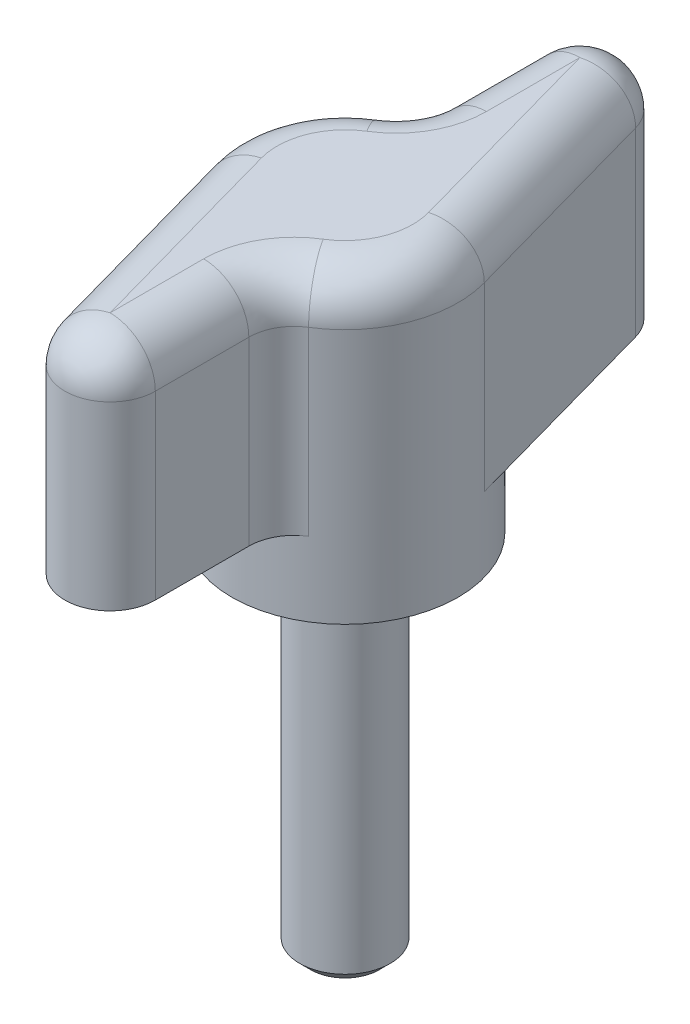
ISO-10303-21;
HEADER;
FILE_DESCRIPTION(('STEP AP214'),'2;1');
FILE_NAME('part.step','',(''),(''),'','','');
FILE_SCHEMA(('AUTOMOTIVE_DESIGN { 1 0 10303 214 1 1 1 1 }'));
ENDSEC;
DATA;
#1=APPLICATION_CONTEXT('core data for automotive mechanical design processes');
#2=APPLICATION_PROTOCOL_DEFINITION('international standard','automotive_design',2000,#1);
#3=PRODUCT_CONTEXT('',#1,'mechanical');
#4=PRODUCT('Part','Part','',(#3));
#5=PRODUCT_RELATED_PRODUCT_CATEGORY('part','',(#4));
#6=PRODUCT_DEFINITION_FORMATION('','',#4);
#7=PRODUCT_DEFINITION_CONTEXT('part definition',#1,'design');
#8=PRODUCT_DEFINITION('design','',#6,#7);
#9=PRODUCT_DEFINITION_SHAPE('','',#8);
#10=(LENGTH_UNIT() NAMED_UNIT(*) SI_UNIT(.MILLI.,.METRE.));
#11=(NAMED_UNIT(*) PLANE_ANGLE_UNIT() SI_UNIT($,.RADIAN.));
#12=(NAMED_UNIT(*) SI_UNIT($,.STERADIAN.) SOLID_ANGLE_UNIT());
#13=UNCERTAINTY_MEASURE_WITH_UNIT(LENGTH_MEASURE(1.E-05),#10,'distance_accuracy_value','');
#14=(GEOMETRIC_REPRESENTATION_CONTEXT(3) GLOBAL_UNCERTAINTY_ASSIGNED_CONTEXT((#13)) GLOBAL_UNIT_ASSIGNED_CONTEXT((#10,
#11,#12)) REPRESENTATION_CONTEXT('',''));
#15=CARTESIAN_POINT('',(0.,0.,0.));
#16=DIRECTION('',(0.,0.,1.));
#17=DIRECTION('',(1.,0.,0.));
#18=AXIS2_PLACEMENT_3D('',#15,#16,#17);
#19=CARTESIAN_POINT('',(0.,-25.4,0.));
#20=DIRECTION('',(0.,1.,0.));
#21=DIRECTION('',(0.,0.,1.));
#22=AXIS2_PLACEMENT_3D('',#19,#20,#21);
#23=CYLINDRICAL_SURFACE('',#22,3.175);
#24=CARTESIAN_POINT('',(0.,-24.638,0.));
#25=DIRECTION('',(0.,-1.,0.));
#26=DIRECTION('',(0.,0.,-1.));
#27=AXIS2_PLACEMENT_3D('',#24,#25,#26);
#28=CIRCLE('',#27,3.175);
#29=CARTESIAN_POINT('',(0.,-24.638,-3.175));
#30=VERTEX_POINT('',#29);
#31=EDGE_CURVE('E11',#30,#30,#28,.F.);
#32=ORIENTED_EDGE('',*,*,#31,.T.);
#33=EDGE_LOOP('',(#32));
#34=FACE_BOUND('',#33,.T.);
#35=CARTESIAN_POINT('',(0.,0.,0.));
#36=DIRECTION('',(0.,-1.,0.));
#37=DIRECTION('',(0.,0.,-1.));
#38=AXIS2_PLACEMENT_3D('',#35,#36,#37);
#39=CIRCLE('',#38,3.175);
#40=CARTESIAN_POINT('',(0.,0.,-3.175));
#41=VERTEX_POINT('',#40);
#42=EDGE_CURVE('E55',#41,#41,#39,.T.);
#43=ORIENTED_EDGE('',*,*,#42,.T.);
#44=EDGE_LOOP('',(#43));
#45=FACE_BOUND('',#44,.T.);
#46=ADVANCED_FACE('F44',(#34,#45),#23,.T.);
#47=CARTESIAN_POINT('',(0.,-25.4,0.));
#48=DIRECTION('',(0.,-1.,0.));
#49=DIRECTION('',(0.,0.,-1.));
#50=AXIS2_PLACEMENT_3D('',#47,#48,#49);
#51=PLANE('',#50);
#52=CARTESIAN_POINT('',(0.,-25.4,0.));
#53=DIRECTION('',(0.,-1.,0.));
#54=DIRECTION('',(0.,0.,-1.));
#55=AXIS2_PLACEMENT_3D('',#52,#53,#54);
#56=CIRCLE('',#55,2.413);
#57=CARTESIAN_POINT('',(0.,-25.4,-2.413));
#58=VERTEX_POINT('',#57);
#59=EDGE_CURVE('E51',#58,#58,#56,.T.);
#60=ORIENTED_EDGE('',*,*,#59,.T.);
#61=EDGE_LOOP('',(#60));
#62=FACE_BOUND('',#61,.T.);
#63=ADVANCED_FACE('F65',(#62),#51,.T.);
#64=CARTESIAN_POINT('',(0.,0.,0.));
#65=DIRECTION('',(0.,-1.,0.));
#66=DIRECTION('',(0.,0.,-1.));
#67=AXIS2_PLACEMENT_3D('',#64,#65,#66);
#68=PLANE('',#67);
#69=ORIENTED_EDGE('',*,*,#42,.F.);
#70=EDGE_LOOP('',(#69));
#71=FACE_BOUND('',#70,.T.);
#72=ADVANCED_FACE('F63',(#71),#68,.F.);
#73=CARTESIAN_POINT('',(0.,-25.4,0.));
#74=DIRECTION('',(0.,1.,0.));
#75=DIRECTION('',(0.,0.,1.));
#76=AXIS2_PLACEMENT_3D('',#73,#74,#75);
#77=CONICAL_SURFACE('',#76,2.413,0.785398163397447);
#78=ORIENTED_EDGE('',*,*,#31,.F.);
#79=EDGE_LOOP('',(#78));
#80=FACE_BOUND('',#79,.T.);
#81=ORIENTED_EDGE('',*,*,#59,.F.);
#82=EDGE_LOOP('',(#81));
#83=FACE_BOUND('',#82,.T.);
#84=ADVANCED_FACE('F46',(#80,#83),#77,.T.);
#85=CLOSED_SHELL('',(#46,#63,#72,#84));
#86=MANIFOLD_SOLID_BREP('B2',#85);
#87=CARTESIAN_POINT('',(0.,21.082,0.));
#88=DIRECTION('',(0.,-1.,0.));
#89=DIRECTION('',(0.,0.,-1.));
#90=AXIS2_PLACEMENT_3D('',#87,#88,#89);
#91=CYLINDRICAL_SURFACE('',#90,7.9375);
#92=CARTESIAN_POINT('',(0.,0.,0.));
#93=DIRECTION('',(0.,1.,0.));
#94=DIRECTION('',(0.,0.,1.));
#95=AXIS2_PLACEMENT_3D('',#92,#93,#94);
#96=CIRCLE('',#95,7.9375);
#97=CARTESIAN_POINT('',(0.,0.,7.9375));
#98=VERTEX_POINT('',#97);
#99=EDGE_CURVE('E247',#98,#98,#96,.T.);
#100=ORIENTED_EDGE('',*,*,#99,.T.);
#101=EDGE_LOOP('',(#100));
#102=FACE_BOUND('',#101,.T.);
#103=DIRECTION('',(0.,1.,0.));
#104=VECTOR('',#103,1.);
#105=CARTESIAN_POINT('',(7.64626830975385,5.207,-2.13037254611816));
#106=LINE('',#105,#104);
#107=CARTESIAN_POINT('',(7.64626830975385,5.207,-2.13037254611816));
#108=VERTEX_POINT('',#107);
#109=CARTESIAN_POINT('',(7.64626830975385,17.907,-2.13037254611816));
#110=VERTEX_POINT('',#109);
#111=EDGE_CURVE('E248',#108,#110,#106,.T.);
#112=ORIENTED_EDGE('',*,*,#111,.T.);
#113=CARTESIAN_POINT('',(0.,17.907,0.));
#114=DIRECTION('',(0.,1.,0.));
#115=DIRECTION('',(0.,0.,1.));
#116=AXIS2_PLACEMENT_3D('',#113,#114,#115);
#117=CIRCLE('',#116,7.9375);
#118=CARTESIAN_POINT('',(4.18894174287397,17.907,6.74215642986782));
#119=VERTEX_POINT('',#118);
#120=EDGE_CURVE('E291',#110,#119,#117,.F.);
#121=ORIENTED_EDGE('',*,*,#120,.T.);
#122=DIRECTION('',(0.,-1.,0.));
#123=VECTOR('',#122,1.);
#124=CARTESIAN_POINT('',(4.18894174287397,21.082,6.74215642986782));
#125=LINE('',#124,#123);
#126=CARTESIAN_POINT('',(4.18894174287397,5.207,6.74215642986782));
#127=VERTEX_POINT('',#126);
#128=EDGE_CURVE('E288',#119,#127,#125,.T.);
#129=ORIENTED_EDGE('',*,*,#128,.T.);
#130=CARTESIAN_POINT('',(0.,5.207,0.));
#131=DIRECTION('',(0.,-1.,0.));
#132=DIRECTION('',(0.,0.,-1.));
#133=AXIS2_PLACEMENT_3D('',#130,#131,#132);
#134=CIRCLE('',#133,7.9375);
#135=CARTESIAN_POINT('',(-7.64626830975387,5.207,2.13037254611811));
#136=VERTEX_POINT('',#135);
#137=EDGE_CURVE('E217',#127,#136,#134,.T.);
#138=ORIENTED_EDGE('',*,*,#137,.T.);
#139=DIRECTION('',(0.,1.,0.));
#140=VECTOR('',#139,1.);
#141=CARTESIAN_POINT('',(-7.64626830975387,5.207,2.13037254611811));
#142=LINE('',#141,#140);
#143=CARTESIAN_POINT('',(-7.64626830975387,17.907,2.13037254611811));
#144=VERTEX_POINT('',#143);
#145=EDGE_CURVE('E207',#136,#144,#142,.T.);
#146=ORIENTED_EDGE('',*,*,#145,.T.);
#147=CARTESIAN_POINT('',(0.,17.907,0.));
#148=DIRECTION('',(0.,1.,0.));
#149=DIRECTION('',(0.,0.,1.));
#150=AXIS2_PLACEMENT_3D('',#147,#148,#149);
#151=CIRCLE('',#150,7.9375);
#152=CARTESIAN_POINT('',(-4.18894174287402,17.907,-6.74215642986779));
#153=VERTEX_POINT('',#152);
#154=EDGE_CURVE('E286',#144,#153,#151,.F.);
#155=ORIENTED_EDGE('',*,*,#154,.T.);
#156=DIRECTION('',(0.,-1.,0.));
#157=VECTOR('',#156,1.);
#158=CARTESIAN_POINT('',(-4.18894174287402,21.082,-6.74215642986779));
#159=LINE('',#158,#157);
#160=CARTESIAN_POINT('',(-4.18894174287402,5.207,-6.74215642986779));
#161=VERTEX_POINT('',#160);
#162=EDGE_CURVE('E283',#153,#161,#159,.T.);
#163=ORIENTED_EDGE('',*,*,#162,.T.);
#164=CARTESIAN_POINT('',(0.,5.207,0.));
#165=DIRECTION('',(0.,-1.,0.));
#166=DIRECTION('',(0.,0.,1.));
#167=AXIS2_PLACEMENT_3D('',#164,#165,#166);
#168=CIRCLE('',#167,7.9375);
#169=EDGE_CURVE('E237',#161,#108,#168,.T.);
#170=ORIENTED_EDGE('',*,*,#169,.T.);
#171=EDGE_LOOP('',(#112,#121,#129,#138,#146,#155,#163,#170));
#172=FACE_BOUND('',#171,.T.);
#173=ADVANCED_FACE('F99',(#102,#172),#91,.T.);
#174=CARTESIAN_POINT('',(0.,21.082,0.));
#175=DIRECTION('',(0.,1.,0.));
#176=DIRECTION('',(0.,0.,1.));
#177=AXIS2_PLACEMENT_3D('',#174,#175,#176);
#178=PLANE('',#177);
#179=CARTESIAN_POINT('',(0.,21.082,0.));
#180=DIRECTION('',(0.,1.,0.));
#181=DIRECTION('',(0.,0.,1.));
#182=AXIS2_PLACEMENT_3D('',#179,#180,#181);
#183=CIRCLE('',#182,4.7625);
#184=CARTESIAN_POINT('',(2.51336504572438,21.082,4.04529385792069));
#185=VERTEX_POINT('',#184);
#186=CARTESIAN_POINT('',(4.58776098585231,21.082,-1.2782235276709));
#187=VERTEX_POINT('',#186);
#188=EDGE_CURVE('E270',#185,#187,#183,.T.);
#189=ORIENTED_EDGE('',*,*,#188,.T.);
#190=DIRECTION('',(-0.268393391636934,0.,-0.963309393354816));
#191=VECTOR('',#190,1.);
#192=CARTESIAN_POINT('',(4.58776098585231,21.082,-1.2782235276709));
#193=LINE('',#192,#191);
#194=CARTESIAN_POINT('',(0.485481559976375,21.082,-16.002));
#195=VERTEX_POINT('',#194);
#196=EDGE_CURVE('E272',#187,#195,#193,.T.);
#197=ORIENTED_EDGE('',*,*,#196,.T.);
#198=DIRECTION('',(0.,0.,1.));
#199=VECTOR('',#198,1.);
#200=CARTESIAN_POINT('',(0.485481559976374,21.082,0.));
#201=LINE('',#200,#199);
#202=CARTESIAN_POINT('',(0.485481559976374,21.082,-9.43901900181491));
#203=VERTEX_POINT('',#202);
#204=EDGE_CURVE('E264',#195,#203,#201,.T.);
#205=ORIENTED_EDGE('',*,*,#204,.T.);
#206=CARTESIAN_POINT('',(-5.86451844002362,21.082,-9.43901900181491));
#207=DIRECTION('',(0.,1.,0.));
#208=DIRECTION('',(0.,0.,1.));
#209=AXIS2_PLACEMENT_3D('',#206,#207,#208);
#210=CIRCLE('',#209,6.35);
#211=CARTESIAN_POINT('',(-2.51336504572441,21.082,-4.04529385792067));
#212=VERTEX_POINT('',#211);
#213=EDGE_CURVE('E261',#212,#203,#210,.T.);
#214=ORIENTED_EDGE('',*,*,#213,.F.);
#215=CARTESIAN_POINT('',(0.,21.082,0.));
#216=DIRECTION('',(0.,1.,0.));
#217=DIRECTION('',(0.,0.,1.));
#218=AXIS2_PLACEMENT_3D('',#215,#216,#217);
#219=CIRCLE('',#218,4.7625);
#220=CARTESIAN_POINT('',(-4.58776098585232,21.082,1.27822352767086));
#221=VERTEX_POINT('',#220);
#222=EDGE_CURVE('E255',#212,#221,#219,.T.);
#223=ORIENTED_EDGE('',*,*,#222,.T.);
#224=DIRECTION('',(0.268393391636927,0.,0.963309393354818));
#225=VECTOR('',#224,1.);
#226=CARTESIAN_POINT('',(-4.58776098585232,21.082,1.27822352767087));
#227=LINE('',#226,#225);
#228=CARTESIAN_POINT('',(-0.485481559976487,21.082,16.002));
#229=VERTEX_POINT('',#228);
#230=EDGE_CURVE('E257',#221,#229,#227,.T.);
#231=ORIENTED_EDGE('',*,*,#230,.T.);
#232=DIRECTION('',(0.,0.,-1.));
#233=VECTOR('',#232,1.);
#234=CARTESIAN_POINT('',(-0.485481559976374,21.082,0.));
#235=LINE('',#234,#233);
#236=CARTESIAN_POINT('',(-0.48548155997644,21.082,9.4390190018149));
#237=VERTEX_POINT('',#236);
#238=EDGE_CURVE('E259',#229,#237,#235,.T.);
#239=ORIENTED_EDGE('',*,*,#238,.T.);
#240=CARTESIAN_POINT('',(5.86451844002356,21.082,9.43901900181495));
#241=DIRECTION('',(0.,1.,0.));
#242=DIRECTION('',(0.,0.,1.));
#243=AXIS2_PLACEMENT_3D('',#240,#241,#242);
#244=CIRCLE('',#243,6.35);
#245=EDGE_CURVE('E267',#185,#237,#244,.T.);
#246=ORIENTED_EDGE('',*,*,#245,.F.);
#247=EDGE_LOOP('',(#189,#197,#205,#214,#223,#231,#239,#246));
#248=FACE_BOUND('',#247,.T.);
#249=ADVANCED_FACE('F350',(#248),#178,.T.);
#250=CARTESIAN_POINT('',(0.,0.,0.));
#251=DIRECTION('',(0.,1.,0.));
#252=DIRECTION('',(0.,0.,1.));
#253=AXIS2_PLACEMENT_3D('',#250,#251,#252);
#254=PLANE('',#253);
#255=ORIENTED_EDGE('',*,*,#99,.F.);
#256=EDGE_LOOP('',(#255));
#257=FACE_BOUND('',#256,.T.);
#258=ADVANCED_FACE('F389',(#257),#254,.F.);
#259=CARTESIAN_POINT('',(0.485481559976374,5.207,-16.002));
#260=DIRECTION('',(0.,1.,0.));
#261=DIRECTION('',(0.,0.,1.));
#262=AXIS2_PLACEMENT_3D('',#259,#260,#261);
#263=CYLINDRICAL_SURFACE('',#262,3.175);
#264=DIRECTION('',(0.,1.,0.));
#265=VECTOR('',#264,1.);
#266=CARTESIAN_POINT('',(-2.68951844002363,5.207,-16.002));
#267=LINE('',#266,#265);
#268=CARTESIAN_POINT('',(-2.68951844002363,5.207,-16.002));
#269=VERTEX_POINT('',#268);
#270=CARTESIAN_POINT('',(-2.68951844002363,17.907,-16.002));
#271=VERTEX_POINT('',#270);
#272=EDGE_CURVE('E243',#269,#271,#267,.T.);
#273=ORIENTED_EDGE('',*,*,#272,.T.);
#274=CARTESIAN_POINT('',(0.485481559976374,17.907,-16.002));
#275=DIRECTION('',(0.,1.,0.));
#276=DIRECTION('',(0.,0.,1.));
#277=AXIS2_PLACEMENT_3D('',#274,#275,#276);
#278=CIRCLE('',#277,3.175);
#279=CARTESIAN_POINT('',(3.54398888387792,17.907,-16.8541490184473));
#280=VERTEX_POINT('',#279);
#281=EDGE_CURVE('E279',#271,#280,#278,.F.);
#282=ORIENTED_EDGE('',*,*,#281,.T.);
#283=DIRECTION('',(0.,1.,0.));
#284=VECTOR('',#283,1.);
#285=CARTESIAN_POINT('',(3.54398888387792,5.207,-16.8541490184473));
#286=LINE('',#285,#284);
#287=CARTESIAN_POINT('',(3.54398888387792,5.207,-16.8541490184473));
#288=VERTEX_POINT('',#287);
#289=EDGE_CURVE('E244',#288,#280,#286,.T.);
#290=ORIENTED_EDGE('',*,*,#289,.F.);
#291=CARTESIAN_POINT('',(0.485481559976374,5.207,-16.002));
#292=DIRECTION('',(0.,1.,0.));
#293=DIRECTION('',(0.,0.,1.));
#294=AXIS2_PLACEMENT_3D('',#291,#292,#293);
#295=CIRCLE('',#294,3.175);
#296=EDGE_CURVE('E229',#288,#269,#295,.T.);
#297=ORIENTED_EDGE('',*,*,#296,.T.);
#298=EDGE_LOOP('',(#273,#282,#290,#297));
#299=FACE_BOUND('',#298,.T.);
#300=ADVANCED_FACE('F378',(#299),#263,.T.);
#301=CARTESIAN_POINT('',(3.54398888387792,5.207,-16.8541490184473));
#302=DIRECTION('',(0.963309393354816,0.,-0.268393391636934));
#303=DIRECTION('',(-0.268393391636934,0.,-0.963309393354816));
#304=AXIS2_PLACEMENT_3D('',#301,#302,#303);
#305=PLANE('',#304);
#306=ORIENTED_EDGE('',*,*,#289,.T.);
#307=DIRECTION('',(-0.268393391636934,0.,-0.963309393354816));
#308=VECTOR('',#307,1.);
#309=CARTESIAN_POINT('',(3.54398888387792,17.907,-16.8541490184473));
#310=LINE('',#309,#308);
#311=EDGE_CURVE('E281',#280,#110,#310,.F.);
#312=ORIENTED_EDGE('',*,*,#311,.T.);
#313=ORIENTED_EDGE('',*,*,#111,.F.);
#314=DIRECTION('',(-0.268393391636934,0.,-0.963309393354816));
#315=VECTOR('',#314,1.);
#316=CARTESIAN_POINT('',(3.54398888387792,5.207,-16.8541490184473));
#317=LINE('',#316,#315);
#318=EDGE_CURVE('E240',#108,#288,#317,.T.);
#319=ORIENTED_EDGE('',*,*,#318,.T.);
#320=EDGE_LOOP('',(#306,#312,#313,#319));
#321=FACE_BOUND('',#320,.T.);
#322=ADVANCED_FACE('F381',(#321),#305,.T.);
#323=CARTESIAN_POINT('',(-2.68951844002363,5.207,-16.002));
#324=DIRECTION('',(-1.,0.,0.));
#325=DIRECTION('',(0.,0.,1.));
#326=AXIS2_PLACEMENT_3D('',#323,#324,#325);
#327=PLANE('',#326);
#328=DIRECTION('',(0.,-1.,0.));
#329=VECTOR('',#328,1.);
#330=CARTESIAN_POINT('',(-2.68951844002363,5.207,-9.43901900181491));
#331=LINE('',#330,#329);
#332=CARTESIAN_POINT('',(-2.68951844002363,5.207,-9.43901900181491));
#333=VERTEX_POINT('',#332);
#334=CARTESIAN_POINT('',(-2.68951844002363,17.907,-9.43901900181491));
#335=VERTEX_POINT('',#334);
#336=EDGE_CURVE('E274',#333,#335,#331,.F.);
#337=ORIENTED_EDGE('',*,*,#336,.T.);
#338=DIRECTION('',(0.,0.,1.));
#339=VECTOR('',#338,1.);
#340=CARTESIAN_POINT('',(-2.68951844002363,17.907,-16.002));
#341=LINE('',#340,#339);
#342=EDGE_CURVE('E276',#335,#271,#341,.F.);
#343=ORIENTED_EDGE('',*,*,#342,.T.);
#344=ORIENTED_EDGE('',*,*,#272,.F.);
#345=DIRECTION('',(0.,0.,1.));
#346=VECTOR('',#345,1.);
#347=CARTESIAN_POINT('',(-2.68951844002363,5.207,-16.002));
#348=LINE('',#347,#346);
#349=EDGE_CURVE('E234',#269,#333,#348,.T.);
#350=ORIENTED_EDGE('',*,*,#349,.T.);
#351=EDGE_LOOP('',(#337,#343,#344,#350));
#352=FACE_BOUND('',#351,.T.);
#353=ADVANCED_FACE('F376',(#352),#327,.T.);
#354=CARTESIAN_POINT('',(0.485481559976374,5.207,-16.002));
#355=DIRECTION('',(0.,1.,0.));
#356=DIRECTION('',(0.,0.,1.));
#357=AXIS2_PLACEMENT_3D('',#354,#355,#356);
#358=PLANE('',#357);
#359=ORIENTED_EDGE('',*,*,#296,.F.);
#360=ORIENTED_EDGE('',*,*,#318,.F.);
#361=ORIENTED_EDGE('',*,*,#169,.F.);
#362=CARTESIAN_POINT('',(-5.86451844002362,5.207,-9.43901900181491));
#363=DIRECTION('',(0.,1.,0.));
#364=DIRECTION('',(0.,0.,1.));
#365=AXIS2_PLACEMENT_3D('',#362,#363,#364);
#366=CIRCLE('',#365,3.175);
#367=EDGE_CURVE('E42',#161,#333,#366,.T.);
#368=ORIENTED_EDGE('',*,*,#367,.T.);
#369=ORIENTED_EDGE('',*,*,#349,.F.);
#370=EDGE_LOOP('',(#359,#360,#361,#368,#369));
#371=FACE_BOUND('',#370,.T.);
#372=ADVANCED_FACE('F373',(#371),#358,.F.);
#373=CARTESIAN_POINT('',(-0.485481559976486,5.207,16.002));
#374=DIRECTION('',(0.,1.,0.));
#375=DIRECTION('',(0.,0.,1.));
#376=AXIS2_PLACEMENT_3D('',#373,#374,#375);
#377=CYLINDRICAL_SURFACE('',#376,3.175);
#378=DIRECTION('',(0.,1.,0.));
#379=VECTOR('',#378,1.);
#380=CARTESIAN_POINT('',(2.68951844002351,5.207,16.002));
#381=LINE('',#380,#379);
#382=CARTESIAN_POINT('',(2.68951844002351,5.207,16.002));
#383=VERTEX_POINT('',#382);
#384=CARTESIAN_POINT('',(2.68951844002351,17.907,16.002));
#385=VERTEX_POINT('',#384);
#386=EDGE_CURVE('E200',#383,#385,#381,.T.);
#387=ORIENTED_EDGE('',*,*,#386,.T.);
#388=CARTESIAN_POINT('',(-0.485481559976486,17.907,16.002));
#389=DIRECTION('',(0.,1.,0.));
#390=DIRECTION('',(0.,0.,1.));
#391=AXIS2_PLACEMENT_3D('',#388,#389,#390);
#392=CIRCLE('',#391,3.175);
#393=CARTESIAN_POINT('',(-3.54398888387803,17.907,16.8541490184472));
#394=VERTEX_POINT('',#393);
#395=EDGE_CURVE('E116',#385,#394,#392,.F.);
#396=ORIENTED_EDGE('',*,*,#395,.T.);
#397=DIRECTION('',(0.,1.,0.));
#398=VECTOR('',#397,1.);
#399=CARTESIAN_POINT('',(-3.54398888387803,5.207,16.8541490184472));
#400=LINE('',#399,#398);
#401=CARTESIAN_POINT('',(-3.54398888387803,5.207,16.8541490184472));
#402=VERTEX_POINT('',#401);
#403=EDGE_CURVE('E220',#402,#394,#400,.T.);
#404=ORIENTED_EDGE('',*,*,#403,.F.);
#405=CARTESIAN_POINT('',(-0.485481559976486,5.207,16.002));
#406=DIRECTION('',(0.,1.,0.));
#407=DIRECTION('',(0.,0.,-1.));
#408=AXIS2_PLACEMENT_3D('',#405,#406,#407);
#409=CIRCLE('',#408,3.175);
#410=EDGE_CURVE('E214',#402,#383,#409,.T.);
#411=ORIENTED_EDGE('',*,*,#410,.T.);
#412=EDGE_LOOP('',(#387,#396,#404,#411));
#413=FACE_BOUND('',#412,.T.);
#414=ADVANCED_FACE('F219',(#413),#377,.T.);
#415=CARTESIAN_POINT('',(-3.54398888387803,5.207,16.8541490184472));
#416=DIRECTION('',(-0.963309393354818,0.,0.268393391636927));
#417=DIRECTION('',(0.268393391636927,0.,0.963309393354818));
#418=AXIS2_PLACEMENT_3D('',#415,#416,#417);
#419=PLANE('',#418);
#420=ORIENTED_EDGE('',*,*,#403,.T.);
#421=DIRECTION('',(0.268393391636927,0.,0.963309393354818));
#422=VECTOR('',#421,1.);
#423=CARTESIAN_POINT('',(-3.54398888387803,17.907,16.8541490184472));
#424=LINE('',#423,#422);
#425=EDGE_CURVE('E296',#394,#144,#424,.F.);
#426=ORIENTED_EDGE('',*,*,#425,.T.);
#427=ORIENTED_EDGE('',*,*,#145,.F.);
#428=DIRECTION('',(0.268393391636927,0.,0.963309393354818));
#429=VECTOR('',#428,1.);
#430=CARTESIAN_POINT('',(-3.54398888387803,5.207,16.8541490184472));
#431=LINE('',#430,#429);
#432=EDGE_CURVE('E208',#136,#402,#431,.T.);
#433=ORIENTED_EDGE('',*,*,#432,.T.);
#434=EDGE_LOOP('',(#420,#426,#427,#433));
#435=FACE_BOUND('',#434,.T.);
#436=ADVANCED_FACE('F439',(#435),#419,.T.);
#437=CARTESIAN_POINT('',(2.68951844002351,5.207,16.002));
#438=DIRECTION('',(1.,0.,0.));
#439=DIRECTION('',(0.,0.,-1.));
#440=AXIS2_PLACEMENT_3D('',#437,#438,#439);
#441=PLANE('',#440);
#442=DIRECTION('',(0.,-1.,0.));
#443=VECTOR('',#442,1.);
#444=CARTESIAN_POINT('',(2.68951844002356,5.207,9.43901900181493));
#445=LINE('',#444,#443);
#446=CARTESIAN_POINT('',(2.68951844002356,5.207,9.43901900181493));
#447=VERTEX_POINT('',#446);
#448=CARTESIAN_POINT('',(2.68951844002356,17.907,9.43901900181493));
#449=VERTEX_POINT('',#448);
#450=EDGE_CURVE('E124',#447,#449,#445,.F.);
#451=ORIENTED_EDGE('',*,*,#450,.T.);
#452=DIRECTION('',(0.,0.,-1.));
#453=VECTOR('',#452,1.);
#454=CARTESIAN_POINT('',(2.68951844002351,17.907,16.002));
#455=LINE('',#454,#453);
#456=EDGE_CURVE('E204',#449,#385,#455,.F.);
#457=ORIENTED_EDGE('',*,*,#456,.T.);
#458=ORIENTED_EDGE('',*,*,#386,.F.);
#459=DIRECTION('',(0.,0.,-1.));
#460=VECTOR('',#459,1.);
#461=CARTESIAN_POINT('',(2.68951844002351,5.207,16.002));
#462=LINE('',#461,#460);
#463=EDGE_CURVE('E203',#383,#447,#462,.T.);
#464=ORIENTED_EDGE('',*,*,#463,.T.);
#465=EDGE_LOOP('',(#451,#457,#458,#464));
#466=FACE_BOUND('',#465,.T.);
#467=ADVANCED_FACE('F202',(#466),#441,.T.);
#468=CARTESIAN_POINT('',(-0.485481559976486,5.207,16.002));
#469=DIRECTION('',(0.,1.,0.));
#470=DIRECTION('',(0.,0.,-1.));
#471=AXIS2_PLACEMENT_3D('',#468,#469,#470);
#472=PLANE('',#471);
#473=ORIENTED_EDGE('',*,*,#410,.F.);
#474=ORIENTED_EDGE('',*,*,#432,.F.);
#475=ORIENTED_EDGE('',*,*,#137,.F.);
#476=CARTESIAN_POINT('',(5.86451844002356,5.207,9.43901900181495));
#477=DIRECTION('',(0.,1.,0.));
#478=DIRECTION('',(0.,0.,1.));
#479=AXIS2_PLACEMENT_3D('',#476,#477,#478);
#480=CIRCLE('',#479,3.175);
#481=EDGE_CURVE('E108',#127,#447,#480,.T.);
#482=ORIENTED_EDGE('',*,*,#481,.T.);
#483=ORIENTED_EDGE('',*,*,#463,.F.);
#484=EDGE_LOOP('',(#473,#474,#475,#482,#483));
#485=FACE_BOUND('',#484,.T.);
#486=ADVANCED_FACE('F212',(#485),#472,.F.);
#487=CARTESIAN_POINT('',(5.86451844002356,21.082,9.43901900181495));
#488=DIRECTION('',(0.,-1.,0.));
#489=DIRECTION('',(0.,0.,-1.));
#490=AXIS2_PLACEMENT_3D('',#487,#488,#489);
#491=CYLINDRICAL_SURFACE('',#490,3.175);
#492=ORIENTED_EDGE('',*,*,#481,.F.);
#493=ORIENTED_EDGE('',*,*,#128,.F.);
#494=CARTESIAN_POINT('',(5.86451844002356,17.907,9.43901900181495));
#495=DIRECTION('',(0.,1.,0.));
#496=DIRECTION('',(0.,0.,1.));
#497=AXIS2_PLACEMENT_3D('',#494,#495,#496);
#498=CIRCLE('',#497,3.175);
#499=EDGE_CURVE('E103',#449,#119,#498,.F.);
#500=ORIENTED_EDGE('',*,*,#499,.F.);
#501=ORIENTED_EDGE('',*,*,#450,.F.);
#502=EDGE_LOOP('',(#492,#493,#500,#501));
#503=FACE_BOUND('',#502,.T.);
#504=ADVANCED_FACE('F101',(#503),#491,.F.);
#505=CARTESIAN_POINT('',(-0.485481559976374,17.907,0.));
#506=DIRECTION('',(0.,0.,-1.));
#507=DIRECTION('',(-1.,0.,0.));
#508=AXIS2_PLACEMENT_3D('',#505,#506,#507);
#509=CYLINDRICAL_SURFACE('',#508,3.175);
#510=CARTESIAN_POINT('',(-0.485481559976486,17.907,16.002));
#511=DIRECTION('',(0.,0.,1.));
#512=DIRECTION('',(1.,0.,0.));
#513=AXIS2_PLACEMENT_3D('',#510,#511,#512);
#514=CIRCLE('',#513,3.175);
#515=EDGE_CURVE('E324',#385,#229,#514,.T.);
#516=ORIENTED_EDGE('',*,*,#515,.F.);
#517=ORIENTED_EDGE('',*,*,#456,.F.);
#518=CARTESIAN_POINT('',(-0.48548155997644,17.907,9.4390190018149));
#519=DIRECTION('',(0.,0.,-1.));
#520=DIRECTION('',(-1.,0.,0.));
#521=AXIS2_PLACEMENT_3D('',#518,#519,#520);
#522=CIRCLE('',#521,3.175);
#523=EDGE_CURVE('E223',#237,#449,#522,.T.);
#524=ORIENTED_EDGE('',*,*,#523,.F.);
#525=ORIENTED_EDGE('',*,*,#238,.F.);
#526=EDGE_LOOP('',(#516,#517,#524,#525));
#527=FACE_BOUND('',#526,.T.);
#528=ADVANCED_FACE('F334',(#527),#509,.T.);
#529=CARTESIAN_POINT('',(5.86451844002356,17.907,9.43901900181495));
#530=DIRECTION('',(0.,1.,0.));
#531=DIRECTION('',(0.,0.,1.));
#532=AXIS2_PLACEMENT_3D('',#529,#530,#531);
#533=TOROIDAL_SURFACE('',#532,6.35,3.175);
#534=ORIENTED_EDGE('',*,*,#523,.T.);
#535=ORIENTED_EDGE('',*,*,#499,.T.);
#536=CARTESIAN_POINT('',(2.51336504572438,17.907,4.04529385792069));
#537=DIRECTION('',(-0.849405534471536,0.,0.527740692015618));
#538=DIRECTION('',(0.527740692015618,0.,0.849405534471536));
#539=AXIS2_PLACEMENT_3D('',#536,#537,#538);
#540=CIRCLE('',#539,3.175);
#541=EDGE_CURVE('E321',#185,#119,#540,.F.);
#542=ORIENTED_EDGE('',*,*,#541,.F.);
#543=ORIENTED_EDGE('',*,*,#245,.T.);
#544=EDGE_LOOP('',(#534,#535,#542,#543));
#545=FACE_BOUND('',#544,.T.);
#546=ADVANCED_FACE('F329',(#545),#533,.T.);
#547=CARTESIAN_POINT('',(-0.485481559976486,17.907,16.002));
#548=DIRECTION('',(0.,0.,1.));
#549=DIRECTION('',(1.,0.,0.));
#550=AXIS2_PLACEMENT_3D('',#547,#548,#549);
#551=SPHERICAL_SURFACE('',#550,3.175);
#552=ORIENTED_EDGE('',*,*,#395,.F.);
#553=ORIENTED_EDGE('',*,*,#515,.T.);
#554=CARTESIAN_POINT('',(-0.485481559976486,17.907,16.002));
#555=DIRECTION('',(-0.268393391636927,0.,-0.963309393354818));
#556=DIRECTION('',(-0.963309393354818,0.,0.268393391636927));
#557=AXIS2_PLACEMENT_3D('',#554,#555,#556);
#558=CIRCLE('',#557,3.175);
#559=EDGE_CURVE('E318',#394,#229,#558,.T.);
#560=ORIENTED_EDGE('',*,*,#559,.F.);
#561=EDGE_LOOP('',(#552,#553,#560));
#562=FACE_BOUND('',#561,.T.);
#563=ADVANCED_FACE('F423',(#562),#551,.T.);
#564=CARTESIAN_POINT('',(0.,17.907,0.));
#565=DIRECTION('',(0.,1.,0.));
#566=DIRECTION('',(0.,0.,1.));
#567=AXIS2_PLACEMENT_3D('',#564,#565,#566);
#568=TOROIDAL_SURFACE('',#567,4.7625,3.175);
#569=ORIENTED_EDGE('',*,*,#541,.T.);
#570=ORIENTED_EDGE('',*,*,#120,.F.);
#571=CARTESIAN_POINT('',(4.58776098585231,17.907,-1.2782235276709));
#572=DIRECTION('',(-0.268393391636934,0.,-0.963309393354816));
#573=DIRECTION('',(-0.963309393354816,0.,0.268393391636934));
#574=AXIS2_PLACEMENT_3D('',#571,#572,#573);
#575=CIRCLE('',#574,3.175);
#576=EDGE_CURVE('E315',#187,#110,#575,.T.);
#577=ORIENTED_EDGE('',*,*,#576,.F.);
#578=ORIENTED_EDGE('',*,*,#188,.F.);
#579=EDGE_LOOP('',(#569,#570,#577,#578));
#580=FACE_BOUND('',#579,.T.);
#581=ADVANCED_FACE('F341',(#580),#568,.T.);
#582=CARTESIAN_POINT('',(-4.58776098585232,17.907,1.27822352767087));
#583=DIRECTION('',(0.268393391636927,0.,0.963309393354818));
#584=DIRECTION('',(0.963309393354818,0.,-0.268393391636927));
#585=AXIS2_PLACEMENT_3D('',#582,#583,#584);
#586=CYLINDRICAL_SURFACE('',#585,3.175);
#587=ORIENTED_EDGE('',*,*,#559,.T.);
#588=ORIENTED_EDGE('',*,*,#230,.F.);
#589=CARTESIAN_POINT('',(-4.58776098585232,17.907,1.27822352767087));
#590=DIRECTION('',(-0.268393391636927,0.,-0.963309393354818));
#591=DIRECTION('',(-0.963309393354818,0.,0.268393391636927));
#592=AXIS2_PLACEMENT_3D('',#589,#590,#591);
#593=CIRCLE('',#592,3.175);
#594=EDGE_CURVE('E312',#144,#221,#593,.T.);
#595=ORIENTED_EDGE('',*,*,#594,.F.);
#596=ORIENTED_EDGE('',*,*,#425,.F.);
#597=EDGE_LOOP('',(#587,#588,#595,#596));
#598=FACE_BOUND('',#597,.T.);
#599=ADVANCED_FACE('F356',(#598),#586,.T.);
#600=CARTESIAN_POINT('',(4.58776098585231,17.907,-1.2782235276709));
#601=DIRECTION('',(-0.268393391636934,0.,-0.963309393354816));
#602=DIRECTION('',(-0.963309393354816,0.,0.268393391636934));
#603=AXIS2_PLACEMENT_3D('',#600,#601,#602);
#604=CYLINDRICAL_SURFACE('',#603,3.175);
#605=ORIENTED_EDGE('',*,*,#576,.T.);
#606=ORIENTED_EDGE('',*,*,#311,.F.);
#607=CARTESIAN_POINT('',(0.485481559976375,17.907,-16.002));
#608=DIRECTION('',(-0.268393391636934,0.,-0.963309393354816));
#609=DIRECTION('',(-0.963309393354816,0.,0.268393391636934));
#610=AXIS2_PLACEMENT_3D('',#607,#608,#609);
#611=CIRCLE('',#610,3.175);
#612=EDGE_CURVE('E309',#195,#280,#611,.T.);
#613=ORIENTED_EDGE('',*,*,#612,.F.);
#614=ORIENTED_EDGE('',*,*,#196,.F.);
#615=EDGE_LOOP('',(#605,#606,#613,#614));
#616=FACE_BOUND('',#615,.T.);
#617=ADVANCED_FACE('F346',(#616),#604,.T.);
#618=CARTESIAN_POINT('',(0.,17.907,0.));
#619=DIRECTION('',(0.,1.,0.));
#620=DIRECTION('',(0.,0.,1.));
#621=AXIS2_PLACEMENT_3D('',#618,#619,#620);
#622=TOROIDAL_SURFACE('',#621,4.7625,3.175);
#623=ORIENTED_EDGE('',*,*,#594,.T.);
#624=ORIENTED_EDGE('',*,*,#222,.F.);
#625=CARTESIAN_POINT('',(-2.51336504572441,17.907,-4.04529385792067));
#626=DIRECTION('',(0.849405534471533,0.,-0.527740692015624));
#627=DIRECTION('',(-0.527740692015624,0.,-0.849405534471533));
#628=AXIS2_PLACEMENT_3D('',#625,#626,#627);
#629=CIRCLE('',#628,3.175);
#630=EDGE_CURVE('E306',#153,#212,#629,.T.);
#631=ORIENTED_EDGE('',*,*,#630,.F.);
#632=ORIENTED_EDGE('',*,*,#154,.F.);
#633=EDGE_LOOP('',(#623,#624,#631,#632));
#634=FACE_BOUND('',#633,.T.);
#635=ADVANCED_FACE('F361',(#634),#622,.T.);
#636=CARTESIAN_POINT('',(-5.86451844002362,21.082,-9.43901900181491));
#637=DIRECTION('',(0.,-1.,0.));
#638=DIRECTION('',(0.,0.,-1.));
#639=AXIS2_PLACEMENT_3D('',#636,#637,#638);
#640=CYLINDRICAL_SURFACE('',#639,3.175);
#641=ORIENTED_EDGE('',*,*,#367,.F.);
#642=ORIENTED_EDGE('',*,*,#162,.F.);
#643=CARTESIAN_POINT('',(-5.86451844002362,17.907,-9.43901900181491));
#644=DIRECTION('',(0.,1.,0.));
#645=DIRECTION('',(0.,0.,1.));
#646=AXIS2_PLACEMENT_3D('',#643,#644,#645);
#647=CIRCLE('',#646,3.175);
#648=EDGE_CURVE('E303',#335,#153,#647,.F.);
#649=ORIENTED_EDGE('',*,*,#648,.F.);
#650=ORIENTED_EDGE('',*,*,#336,.F.);
#651=EDGE_LOOP('',(#641,#642,#649,#650));
#652=FACE_BOUND('',#651,.T.);
#653=ADVANCED_FACE('F367',(#652),#640,.F.);
#654=CARTESIAN_POINT('',(0.485481559976374,17.907,-16.002));
#655=DIRECTION('',(0.,0.,1.));
#656=DIRECTION('',(1.,0.,0.));
#657=AXIS2_PLACEMENT_3D('',#654,#655,#656);
#658=SPHERICAL_SURFACE('',#657,3.175);
#659=ORIENTED_EDGE('',*,*,#612,.T.);
#660=ORIENTED_EDGE('',*,*,#281,.F.);
#661=CARTESIAN_POINT('',(0.485481559976374,17.907,-16.002));
#662=DIRECTION('',(0.,0.,1.));
#663=DIRECTION('',(1.,0.,0.));
#664=AXIS2_PLACEMENT_3D('',#661,#662,#663);
#665=CIRCLE('',#664,3.175);
#666=EDGE_CURVE('E301',#195,#271,#665,.T.);
#667=ORIENTED_EDGE('',*,*,#666,.F.);
#668=EDGE_LOOP('',(#659,#660,#667));
#669=FACE_BOUND('',#668,.T.);
#670=ADVANCED_FACE('F408',(#669),#658,.T.);
#671=CARTESIAN_POINT('',(-5.86451844002362,17.907,-9.43901900181491));
#672=DIRECTION('',(0.,1.,0.));
#673=DIRECTION('',(0.,0.,1.));
#674=AXIS2_PLACEMENT_3D('',#671,#672,#673);
#675=TOROIDAL_SURFACE('',#674,6.35,3.175);
#676=ORIENTED_EDGE('',*,*,#630,.T.);
#677=ORIENTED_EDGE('',*,*,#213,.T.);
#678=CARTESIAN_POINT('',(0.485481559976374,17.907,-9.43901900181491));
#679=DIRECTION('',(0.,0.,1.));
#680=DIRECTION('',(1.,0.,0.));
#681=AXIS2_PLACEMENT_3D('',#678,#679,#680);
#682=CIRCLE('',#681,3.175);
#683=EDGE_CURVE('E299',#335,#203,#682,.F.);
#684=ORIENTED_EDGE('',*,*,#683,.F.);
#685=ORIENTED_EDGE('',*,*,#648,.T.);
#686=EDGE_LOOP('',(#676,#677,#684,#685));
#687=FACE_BOUND('',#686,.T.);
#688=ADVANCED_FACE('F404',(#687),#675,.T.);
#689=CARTESIAN_POINT('',(0.485481559976374,17.907,0.));
#690=DIRECTION('',(0.,0.,1.));
#691=DIRECTION('',(1.,0.,0.));
#692=AXIS2_PLACEMENT_3D('',#689,#690,#691);
#693=CYLINDRICAL_SURFACE('',#692,3.175);
#694=ORIENTED_EDGE('',*,*,#666,.T.);
#695=ORIENTED_EDGE('',*,*,#342,.F.);
#696=ORIENTED_EDGE('',*,*,#683,.T.);
#697=ORIENTED_EDGE('',*,*,#204,.F.);
#698=EDGE_LOOP('',(#694,#695,#696,#697));
#699=FACE_BOUND('',#698,.T.);
#700=ADVANCED_FACE('F401',(#699),#693,.T.);
#701=CLOSED_SHELL('',(#173,#249,#258,#300,#322,#353,#372,#414,#436,#467,#486,#504,#528,#546,
#563,#581,#599,#617,#635,#653,#670,#688,#700));
#702=MANIFOLD_SOLID_BREP('B6',#701);
#703=ADVANCED_BREP_SHAPE_REPRESENTATION('',(#18,#86,#702),#14);
#704=SHAPE_DEFINITION_REPRESENTATION(#9,#703);
ENDSEC;
END-ISO-10303-21;
